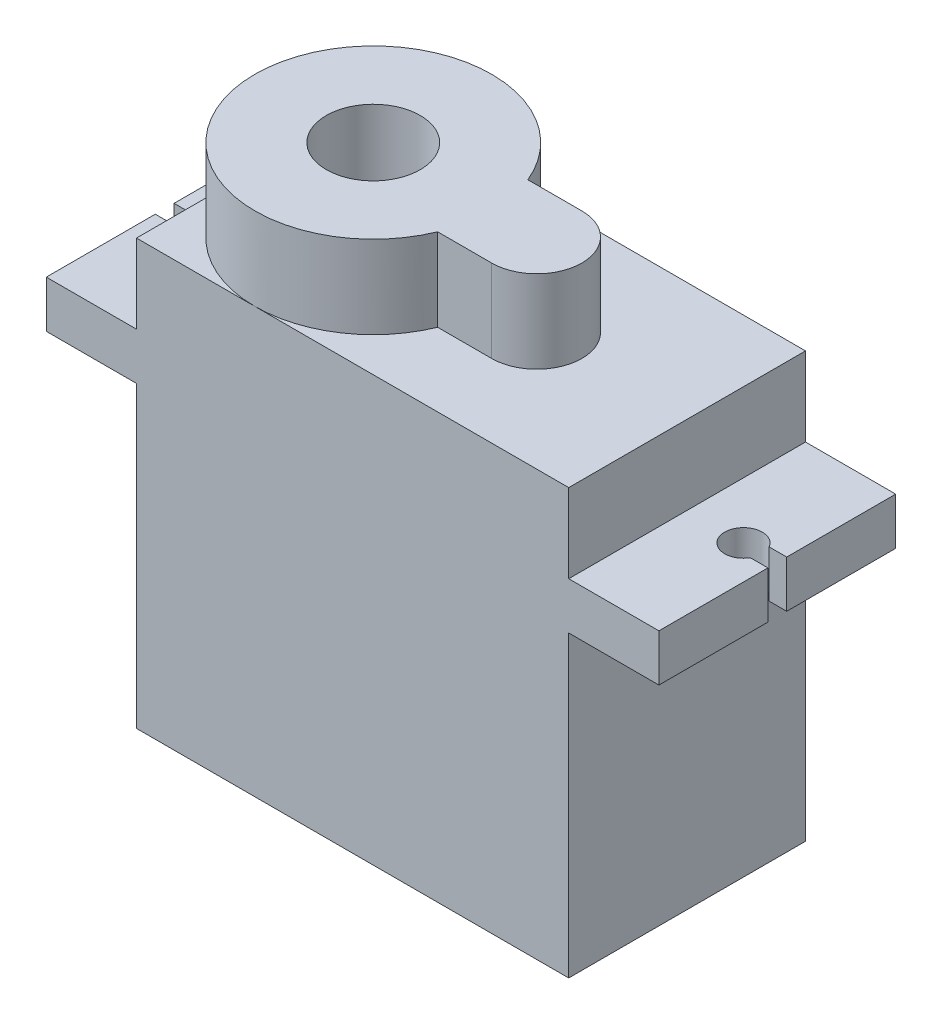
ISO-10303-21;
HEADER;
FILE_DESCRIPTION(('STEP AP214'),'2;1');
FILE_NAME('part.step','',(''),(''),'','','');
FILE_SCHEMA(('AUTOMOTIVE_DESIGN { 1 0 10303 214 1 1 1 1 }'));
ENDSEC;
DATA;
#1=APPLICATION_CONTEXT('core data for automotive mechanical design processes');
#2=APPLICATION_PROTOCOL_DEFINITION('international standard','automotive_design',2000,#1);
#3=PRODUCT_CONTEXT('',#1,'mechanical');
#4=PRODUCT('Part','Part','',(#3));
#5=PRODUCT_RELATED_PRODUCT_CATEGORY('part','',(#4));
#6=PRODUCT_DEFINITION_FORMATION('','',#4);
#7=PRODUCT_DEFINITION_CONTEXT('part definition',#1,'design');
#8=PRODUCT_DEFINITION('design','',#6,#7);
#9=PRODUCT_DEFINITION_SHAPE('','',#8);
#10=(LENGTH_UNIT() NAMED_UNIT(*) SI_UNIT(.MILLI.,.METRE.));
#11=(NAMED_UNIT(*) PLANE_ANGLE_UNIT() SI_UNIT($,.RADIAN.));
#12=(NAMED_UNIT(*) SI_UNIT($,.STERADIAN.) SOLID_ANGLE_UNIT());
#13=UNCERTAINTY_MEASURE_WITH_UNIT(LENGTH_MEASURE(1.E-05),#10,'distance_accuracy_value','');
#14=(GEOMETRIC_REPRESENTATION_CONTEXT(3) GLOBAL_UNCERTAINTY_ASSIGNED_CONTEXT((#13)) GLOBAL_UNIT_ASSIGNED_CONTEXT((#10,
#11,#12)) REPRESENTATION_CONTEXT('',''));
#15=CARTESIAN_POINT('',(0.,0.,0.));
#16=DIRECTION('',(0.,0.,1.));
#17=DIRECTION('',(1.,0.,0.));
#18=AXIS2_PLACEMENT_3D('',#15,#16,#17);
#19=CARTESIAN_POINT('',(-11.5,22.6,12.6));
#20=DIRECTION('',(0.,1.,0.));
#21=DIRECTION('',(0.,0.,1.));
#22=AXIS2_PLACEMENT_3D('',#19,#20,#21);
#23=PLANE('',#22);
#24=CARTESIAN_POINT('',(-5.2,22.6,6.3));
#25=DIRECTION('',(0.,1.,0.));
#26=DIRECTION('',(0.,0.,1.));
#27=AXIS2_PLACEMENT_3D('',#24,#25,#26);
#28=CIRCLE('',#27,6.3);
#29=CARTESIAN_POINT('',(0.624946351684278,22.6,3.9));
#30=VERTEX_POINT('',#29);
#31=CARTESIAN_POINT('',(-5.2,22.6,0.));
#32=VERTEX_POINT('',#31);
#33=EDGE_CURVE('E43',#30,#32,#28,.T.);
#34=ORIENTED_EDGE('',*,*,#33,.F.);
#35=DIRECTION('',(1.,0.,0.));
#36=VECTOR('',#35,1.);
#37=CARTESIAN_POINT('',(0.,22.6,3.9));
#38=LINE('',#37,#36);
#39=CARTESIAN_POINT('',(3.5,22.6,3.9));
#40=VERTEX_POINT('',#39);
#41=EDGE_CURVE('E54',#30,#40,#38,.T.);
#42=ORIENTED_EDGE('',*,*,#41,.T.);
#43=CARTESIAN_POINT('',(3.5,22.6,6.3));
#44=DIRECTION('',(0.,1.,0.));
#45=DIRECTION('',(0.,0.,1.));
#46=AXIS2_PLACEMENT_3D('',#43,#44,#45);
#47=CIRCLE('',#46,2.4);
#48=CARTESIAN_POINT('',(3.5,22.6,8.7));
#49=VERTEX_POINT('',#48);
#50=EDGE_CURVE('E440',#49,#40,#47,.T.);
#51=ORIENTED_EDGE('',*,*,#50,.F.);
#52=DIRECTION('',(1.,0.,0.));
#53=VECTOR('',#52,1.);
#54=CARTESIAN_POINT('',(0.,22.6,8.7));
#55=LINE('',#54,#53);
#56=CARTESIAN_POINT('',(0.624946351684278,22.6,8.7));
#57=VERTEX_POINT('',#56);
#58=EDGE_CURVE('E439',#57,#49,#55,.T.);
#59=ORIENTED_EDGE('',*,*,#58,.F.);
#60=CARTESIAN_POINT('',(-5.2,22.6,12.6));
#61=VERTEX_POINT('',#60);
#62=EDGE_CURVE('E229',#61,#57,#28,.T.);
#63=ORIENTED_EDGE('',*,*,#62,.F.);
#64=DIRECTION('',(1.,0.,0.));
#65=VECTOR('',#64,1.);
#66=CARTESIAN_POINT('',(-11.5,22.6,12.6));
#67=LINE('',#66,#65);
#68=CARTESIAN_POINT('',(11.5,22.6,12.6));
#69=VERTEX_POINT('',#68);
#70=EDGE_CURVE('E307',#61,#69,#67,.T.);
#71=ORIENTED_EDGE('',*,*,#70,.T.);
#72=DIRECTION('',(0.,0.,-1.));
#73=VECTOR('',#72,1.);
#74=CARTESIAN_POINT('',(11.5,22.6,12.6));
#75=LINE('',#74,#73);
#76=CARTESIAN_POINT('',(11.5,22.6,0.));
#77=VERTEX_POINT('',#76);
#78=EDGE_CURVE('E371',#69,#77,#75,.T.);
#79=ORIENTED_EDGE('',*,*,#78,.T.);
#80=DIRECTION('',(1.,0.,0.));
#81=VECTOR('',#80,1.);
#82=CARTESIAN_POINT('',(-11.5,22.6,0.));
#83=LINE('',#82,#81);
#84=EDGE_CURVE('E339',#32,#77,#83,.T.);
#85=ORIENTED_EDGE('',*,*,#84,.F.);
#86=EDGE_LOOP('',(#34,#42,#51,#59,#63,#71,#79,#85));
#87=FACE_BOUND('',#86,.T.);
#88=ADVANCED_FACE('F32',(#87),#23,.T.);
#89=CARTESIAN_POINT('',(-11.5,22.6,6.3));
#90=VERTEX_POINT('',#89);
#91=EDGE_CURVE('E11',#32,#90,#28,.T.);
#92=ORIENTED_EDGE('',*,*,#91,.F.);
#93=CARTESIAN_POINT('',(-11.5,22.6,0.));
#94=VERTEX_POINT('',#93);
#95=EDGE_CURVE('E340',#94,#32,#83,.T.);
#96=ORIENTED_EDGE('',*,*,#95,.F.);
#97=DIRECTION('',(0.,0.,-1.));
#98=VECTOR('',#97,1.);
#99=CARTESIAN_POINT('',(-11.5,22.6,12.6));
#100=LINE('',#99,#98);
#101=EDGE_CURVE('E377',#90,#94,#100,.T.);
#102=ORIENTED_EDGE('',*,*,#101,.F.);
#103=EDGE_LOOP('',(#92,#96,#102));
#104=FACE_BOUND('',#103,.T.);
#105=ADVANCED_FACE('F446',(#104),#23,.T.);
#106=CARTESIAN_POINT('',(-16.3,18.4,12.6));
#107=DIRECTION('',(0.,1.,0.));
#108=DIRECTION('',(0.,0.,1.));
#109=AXIS2_PLACEMENT_3D('',#106,#107,#108);
#110=PLANE('',#109);
#111=DIRECTION('',(1.,0.,0.));
#112=VECTOR('',#111,1.);
#113=CARTESIAN_POINT('',(0.,18.4,6.8));
#114=LINE('',#113,#112);
#115=CARTESIAN_POINT('',(-16.3,18.4,6.8));
#116=VERTEX_POINT('',#115);
#117=CARTESIAN_POINT('',(-15.3660254037844,18.4,6.8));
#118=VERTEX_POINT('',#117);
#119=EDGE_CURVE('E230',#116,#118,#114,.T.);
#120=ORIENTED_EDGE('',*,*,#119,.F.);
#121=DIRECTION('',(0.,0.,-1.));
#122=VECTOR('',#121,1.);
#123=CARTESIAN_POINT('',(-16.3,18.4,12.6));
#124=LINE('',#123,#122);
#125=CARTESIAN_POINT('',(-16.3,18.4,12.6));
#126=VERTEX_POINT('',#125);
#127=EDGE_CURVE('E380',#126,#116,#124,.T.);
#128=ORIENTED_EDGE('',*,*,#127,.F.);
#129=DIRECTION('',(1.,0.,0.));
#130=VECTOR('',#129,1.);
#131=CARTESIAN_POINT('',(-16.3,18.4,12.6));
#132=LINE('',#131,#130);
#133=CARTESIAN_POINT('',(-11.5,18.4,12.6));
#134=VERTEX_POINT('',#133);
#135=EDGE_CURVE('E301',#126,#134,#132,.T.);
#136=ORIENTED_EDGE('',*,*,#135,.T.);
#137=DIRECTION('',(0.,0.,-1.));
#138=VECTOR('',#137,1.);
#139=CARTESIAN_POINT('',(-11.5,18.4,12.6));
#140=LINE('',#139,#138);
#141=CARTESIAN_POINT('',(-11.5,18.4,0.));
#142=VERTEX_POINT('',#141);
#143=EDGE_CURVE('E378',#134,#142,#140,.T.);
#144=ORIENTED_EDGE('',*,*,#143,.T.);
#145=DIRECTION('',(1.,0.,0.));
#146=VECTOR('',#145,1.);
#147=CARTESIAN_POINT('',(-16.3,18.4,0.));
#148=LINE('',#147,#146);
#149=CARTESIAN_POINT('',(-16.3,18.4,0.));
#150=VERTEX_POINT('',#149);
#151=EDGE_CURVE('E333',#150,#142,#148,.T.);
#152=ORIENTED_EDGE('',*,*,#151,.F.);
#153=CARTESIAN_POINT('',(-16.3,18.4,5.8));
#154=VERTEX_POINT('',#153);
#155=EDGE_CURVE('E383',#154,#150,#124,.T.);
#156=ORIENTED_EDGE('',*,*,#155,.F.);
#157=DIRECTION('',(1.,0.,0.));
#158=VECTOR('',#157,1.);
#159=CARTESIAN_POINT('',(0.,18.4,5.8));
#160=LINE('',#159,#158);
#161=CARTESIAN_POINT('',(-15.3660254037844,18.4,5.8));
#162=VERTEX_POINT('',#161);
#163=EDGE_CURVE('E243',#154,#162,#160,.T.);
#164=ORIENTED_EDGE('',*,*,#163,.T.);
#165=CARTESIAN_POINT('',(-14.5,18.4,6.3));
#166=DIRECTION('',(0.,1.,0.));
#167=DIRECTION('',(0.,0.,1.));
#168=AXIS2_PLACEMENT_3D('',#165,#166,#167);
#169=CIRCLE('',#168,1.);
#170=EDGE_CURVE('E233',#162,#118,#169,.F.);
#171=ORIENTED_EDGE('',*,*,#170,.T.);
#172=EDGE_LOOP('',(#120,#128,#136,#144,#152,#156,#164,#171));
#173=FACE_BOUND('',#172,.T.);
#174=ADVANCED_FACE('F429',(#173),#110,.T.);
#175=CARTESIAN_POINT('',(-16.3,15.9,12.6));
#176=DIRECTION('',(-1.,0.,0.));
#177=DIRECTION('',(0.,-1.,0.));
#178=AXIS2_PLACEMENT_3D('',#175,#176,#177);
#179=PLANE('',#178);
#180=DIRECTION('',(0.,0.,-1.));
#181=VECTOR('',#180,1.);
#182=CARTESIAN_POINT('',(-16.3,15.9,12.6));
#183=LINE('',#182,#181);
#184=CARTESIAN_POINT('',(-16.3,15.9,5.8));
#185=VERTEX_POINT('',#184);
#186=CARTESIAN_POINT('',(-16.3,15.9,0.));
#187=VERTEX_POINT('',#186);
#188=EDGE_CURVE('E386',#185,#187,#183,.T.);
#189=ORIENTED_EDGE('',*,*,#188,.F.);
#190=DIRECTION('',(0.,1.,0.));
#191=VECTOR('',#190,1.);
#192=CARTESIAN_POINT('',(-16.3,15.9,5.8));
#193=LINE('',#192,#191);
#194=EDGE_CURVE('E256',#185,#154,#193,.T.);
#195=ORIENTED_EDGE('',*,*,#194,.T.);
#196=ORIENTED_EDGE('',*,*,#155,.T.);
#197=DIRECTION('',(0.,1.,0.));
#198=VECTOR('',#197,1.);
#199=CARTESIAN_POINT('',(-16.3,15.9,0.));
#200=LINE('',#199,#198);
#201=EDGE_CURVE('E330',#187,#150,#200,.T.);
#202=ORIENTED_EDGE('',*,*,#201,.F.);
#203=EDGE_LOOP('',(#189,#195,#196,#202));
#204=FACE_BOUND('',#203,.T.);
#205=ADVANCED_FACE('F425',(#204),#179,.T.);
#206=CARTESIAN_POINT('',(-11.5,15.9,12.6));
#207=DIRECTION('',(0.,-1.,0.));
#208=DIRECTION('',(0.,0.,-1.));
#209=AXIS2_PLACEMENT_3D('',#206,#207,#208);
#210=PLANE('',#209);
#211=DIRECTION('',(1.,0.,0.));
#212=VECTOR('',#211,1.);
#213=CARTESIAN_POINT('',(0.,15.9,6.8));
#214=LINE('',#213,#212);
#215=CARTESIAN_POINT('',(-16.3,15.9,6.8));
#216=VERTEX_POINT('',#215);
#217=CARTESIAN_POINT('',(-15.3660254037844,15.9,6.8));
#218=VERTEX_POINT('',#217);
#219=EDGE_CURVE('E239',#216,#218,#214,.T.);
#220=ORIENTED_EDGE('',*,*,#219,.T.);
#221=CARTESIAN_POINT('',(-14.5,15.9,6.3));
#222=DIRECTION('',(0.,1.,0.));
#223=DIRECTION('',(0.,0.,1.));
#224=AXIS2_PLACEMENT_3D('',#221,#222,#223);
#225=CIRCLE('',#224,1.);
#226=CARTESIAN_POINT('',(-15.3660254037844,15.9,5.8));
#227=VERTEX_POINT('',#226);
#228=EDGE_CURVE('E242',#227,#218,#225,.F.);
#229=ORIENTED_EDGE('',*,*,#228,.F.);
#230=DIRECTION('',(1.,0.,0.));
#231=VECTOR('',#230,1.);
#232=CARTESIAN_POINT('',(0.,15.9,5.8));
#233=LINE('',#232,#231);
#234=EDGE_CURVE('E245',#185,#227,#233,.T.);
#235=ORIENTED_EDGE('',*,*,#234,.F.);
#236=ORIENTED_EDGE('',*,*,#188,.T.);
#237=DIRECTION('',(-1.,0.,0.));
#238=VECTOR('',#237,1.);
#239=CARTESIAN_POINT('',(-11.5,15.9,0.));
#240=LINE('',#239,#238);
#241=CARTESIAN_POINT('',(-11.5,15.9,0.));
#242=VERTEX_POINT('',#241);
#243=EDGE_CURVE('E327',#242,#187,#240,.T.);
#244=ORIENTED_EDGE('',*,*,#243,.F.);
#245=DIRECTION('',(0.,0.,-1.));
#246=VECTOR('',#245,1.);
#247=CARTESIAN_POINT('',(-11.5,15.9,12.6));
#248=LINE('',#247,#246);
#249=CARTESIAN_POINT('',(-11.5,15.9,12.6));
#250=VERTEX_POINT('',#249);
#251=EDGE_CURVE('E387',#250,#242,#248,.T.);
#252=ORIENTED_EDGE('',*,*,#251,.F.);
#253=DIRECTION('',(-1.,0.,0.));
#254=VECTOR('',#253,1.);
#255=CARTESIAN_POINT('',(-11.5,15.9,12.6));
#256=LINE('',#255,#254);
#257=CARTESIAN_POINT('',(-16.3,15.9,12.6));
#258=VERTEX_POINT('',#257);
#259=EDGE_CURVE('E295',#250,#258,#256,.T.);
#260=ORIENTED_EDGE('',*,*,#259,.T.);
#261=EDGE_CURVE('E384',#258,#216,#183,.T.);
#262=ORIENTED_EDGE('',*,*,#261,.T.);
#263=EDGE_LOOP('',(#220,#229,#235,#236,#244,#252,#260,#262));
#264=FACE_BOUND('',#263,.T.);
#265=ADVANCED_FACE('F419',(#264),#210,.T.);
#266=CARTESIAN_POINT('',(16.3,15.9,12.6));
#267=DIRECTION('',(-1.,0.,0.));
#268=DIRECTION('',(0.,-1.,0.));
#269=AXIS2_PLACEMENT_3D('',#266,#267,#268);
#270=PLANE('',#269);
#271=DIRECTION('',(0.,1.,0.));
#272=VECTOR('',#271,1.);
#273=CARTESIAN_POINT('',(16.3,15.9,6.8));
#274=LINE('',#273,#272);
#275=CARTESIAN_POINT('',(16.3,15.9,6.8));
#276=VERTEX_POINT('',#275);
#277=CARTESIAN_POINT('',(16.3,18.4,6.8));
#278=VERTEX_POINT('',#277);
#279=EDGE_CURVE('E281',#276,#278,#274,.T.);
#280=ORIENTED_EDGE('',*,*,#279,.T.);
#281=DIRECTION('',(0.,0.,-1.));
#282=VECTOR('',#281,1.);
#283=CARTESIAN_POINT('',(16.3,18.4,12.6));
#284=LINE('',#283,#282);
#285=CARTESIAN_POINT('',(16.3,18.4,12.6));
#286=VERTEX_POINT('',#285);
#287=EDGE_CURVE('E364',#286,#278,#284,.T.);
#288=ORIENTED_EDGE('',*,*,#287,.F.);
#289=DIRECTION('',(0.,1.,0.));
#290=VECTOR('',#289,1.);
#291=CARTESIAN_POINT('',(16.3,15.9,12.6));
#292=LINE('',#291,#290);
#293=CARTESIAN_POINT('',(16.3,15.9,12.6));
#294=VERTEX_POINT('',#293);
#295=EDGE_CURVE('E316',#294,#286,#292,.T.);
#296=ORIENTED_EDGE('',*,*,#295,.F.);
#297=DIRECTION('',(0.,0.,-1.));
#298=VECTOR('',#297,1.);
#299=CARTESIAN_POINT('',(16.3,15.9,12.6));
#300=LINE('',#299,#298);
#301=EDGE_CURVE('E360',#294,#276,#300,.T.);
#302=ORIENTED_EDGE('',*,*,#301,.T.);
#303=EDGE_LOOP('',(#280,#288,#296,#302));
#304=FACE_BOUND('',#303,.T.);
#305=ADVANCED_FACE('F671',(#304),#270,.F.);
#306=CARTESIAN_POINT('',(11.5,0.,12.6));
#307=DIRECTION('',(0.,-1.,0.));
#308=DIRECTION('',(0.,0.,-1.));
#309=AXIS2_PLACEMENT_3D('',#306,#307,#308);
#310=PLANE('',#309);
#311=DIRECTION('',(-1.,0.,0.));
#312=VECTOR('',#311,1.);
#313=CARTESIAN_POINT('',(11.5,0.,0.));
#314=LINE('',#313,#312);
#315=CARTESIAN_POINT('',(11.5,0.,0.));
#316=VERTEX_POINT('',#315);
#317=CARTESIAN_POINT('',(-11.5,0.,0.));
#318=VERTEX_POINT('',#317);
#319=EDGE_CURVE('E280',#316,#318,#314,.T.);
#320=ORIENTED_EDGE('',*,*,#319,.F.);
#321=DIRECTION('',(0.,0.,-1.));
#322=VECTOR('',#321,1.);
#323=CARTESIAN_POINT('',(11.5,0.,12.6));
#324=LINE('',#323,#322);
#325=CARTESIAN_POINT('',(11.5,0.,12.6));
#326=VERTEX_POINT('',#325);
#327=EDGE_CURVE('E355',#326,#316,#324,.T.);
#328=ORIENTED_EDGE('',*,*,#327,.F.);
#329=DIRECTION('',(-1.,0.,0.));
#330=VECTOR('',#329,1.);
#331=CARTESIAN_POINT('',(11.5,0.,12.6));
#332=LINE('',#331,#330);
#333=CARTESIAN_POINT('',(-11.5,0.,12.6));
#334=VERTEX_POINT('',#333);
#335=EDGE_CURVE('E288',#326,#334,#332,.T.);
#336=ORIENTED_EDGE('',*,*,#335,.T.);
#337=DIRECTION('',(0.,0.,-1.));
#338=VECTOR('',#337,1.);
#339=CARTESIAN_POINT('',(-11.5,0.,12.6));
#340=LINE('',#339,#338);
#341=EDGE_CURVE('E36',#334,#318,#340,.T.);
#342=ORIENTED_EDGE('',*,*,#341,.T.);
#343=EDGE_LOOP('',(#320,#328,#336,#342));
#344=FACE_BOUND('',#343,.T.);
#345=ADVANCED_FACE('F34',(#344),#310,.T.);
#346=CARTESIAN_POINT('',(11.5,0.,12.6));
#347=DIRECTION('',(-1.,0.,0.));
#348=DIRECTION('',(0.,0.,1.));
#349=AXIS2_PLACEMENT_3D('',#346,#347,#348);
#350=PLANE('',#349);
#351=DIRECTION('',(0.,1.,0.));
#352=VECTOR('',#351,1.);
#353=CARTESIAN_POINT('',(11.5,0.,0.));
#354=LINE('',#353,#352);
#355=CARTESIAN_POINT('',(11.5,15.9,0.));
#356=VERTEX_POINT('',#355);
#357=EDGE_CURVE('E292',#316,#356,#354,.T.);
#358=ORIENTED_EDGE('',*,*,#357,.T.);
#359=DIRECTION('',(0.,0.,-1.));
#360=VECTOR('',#359,1.);
#361=CARTESIAN_POINT('',(11.5,15.9,12.6));
#362=LINE('',#361,#360);
#363=CARTESIAN_POINT('',(11.5,15.9,12.6));
#364=VERTEX_POINT('',#363);
#365=EDGE_CURVE('E357',#364,#356,#362,.T.);
#366=ORIENTED_EDGE('',*,*,#365,.F.);
#367=DIRECTION('',(0.,1.,0.));
#368=VECTOR('',#367,1.);
#369=CARTESIAN_POINT('',(11.5,0.,12.6));
#370=LINE('',#369,#368);
#371=EDGE_CURVE('E320',#326,#364,#370,.T.);
#372=ORIENTED_EDGE('',*,*,#371,.F.);
#373=ORIENTED_EDGE('',*,*,#327,.T.);
#374=EDGE_LOOP('',(#358,#366,#372,#373));
#375=FACE_BOUND('',#374,.T.);
#376=ADVANCED_FACE('F403',(#375),#350,.F.);
#377=CARTESIAN_POINT('',(11.5,15.9,12.6));
#378=DIRECTION('',(0.,1.,0.));
#379=DIRECTION('',(0.,0.,1.));
#380=AXIS2_PLACEMENT_3D('',#377,#378,#379);
#381=PLANE('',#380);
#382=CARTESIAN_POINT('',(16.3,15.9,5.8));
#383=VERTEX_POINT('',#382);
#384=CARTESIAN_POINT('',(16.3,15.9,0.));
#385=VERTEX_POINT('',#384);
#386=EDGE_CURVE('E363',#383,#385,#300,.T.);
#387=ORIENTED_EDGE('',*,*,#386,.F.);
#388=DIRECTION('',(-1.,0.,0.));
#389=VECTOR('',#388,1.);
#390=CARTESIAN_POINT('',(0.,15.9,5.79999999999994));
#391=LINE('',#390,#389);
#392=CARTESIAN_POINT('',(15.3660254037844,15.9,5.8));
#393=VERTEX_POINT('',#392);
#394=EDGE_CURVE('E262',#383,#393,#391,.T.);
#395=ORIENTED_EDGE('',*,*,#394,.T.);
#396=CARTESIAN_POINT('',(14.5,15.9,6.3));
#397=DIRECTION('',(0.,1.,0.));
#398=DIRECTION('',(0.,0.,1.));
#399=AXIS2_PLACEMENT_3D('',#396,#397,#398);
#400=CIRCLE('',#399,1.);
#401=CARTESIAN_POINT('',(15.3660254037844,15.9,6.8));
#402=VERTEX_POINT('',#401);
#403=EDGE_CURVE('E265',#393,#402,#400,.T.);
#404=ORIENTED_EDGE('',*,*,#403,.T.);
#405=DIRECTION('',(-1.,0.,0.));
#406=VECTOR('',#405,1.);
#407=CARTESIAN_POINT('',(0.,15.9,6.80000000000006));
#408=LINE('',#407,#406);
#409=EDGE_CURVE('E269',#276,#402,#408,.T.);
#410=ORIENTED_EDGE('',*,*,#409,.F.);
#411=ORIENTED_EDGE('',*,*,#301,.F.);
#412=DIRECTION('',(1.,0.,0.));
#413=VECTOR('',#412,1.);
#414=CARTESIAN_POINT('',(11.5,15.9,12.6));
#415=LINE('',#414,#413);
#416=EDGE_CURVE('E318',#364,#294,#415,.T.);
#417=ORIENTED_EDGE('',*,*,#416,.F.);
#418=ORIENTED_EDGE('',*,*,#365,.T.);
#419=DIRECTION('',(1.,0.,0.));
#420=VECTOR('',#419,1.);
#421=CARTESIAN_POINT('',(11.5,15.9,0.));
#422=LINE('',#421,#420);
#423=EDGE_CURVE('E351',#356,#385,#422,.T.);
#424=ORIENTED_EDGE('',*,*,#423,.T.);
#425=EDGE_LOOP('',(#387,#395,#404,#410,#411,#417,#418,#424));
#426=FACE_BOUND('',#425,.T.);
#427=ADVANCED_FACE('F408',(#426),#381,.F.);
#428=CARTESIAN_POINT('',(16.3,18.4,5.8));
#429=VERTEX_POINT('',#428);
#430=CARTESIAN_POINT('',(16.3,18.4,0.));
#431=VERTEX_POINT('',#430);
#432=EDGE_CURVE('E367',#429,#431,#284,.T.);
#433=ORIENTED_EDGE('',*,*,#432,.F.);
#434=DIRECTION('',(0.,1.,0.));
#435=VECTOR('',#434,1.);
#436=CARTESIAN_POINT('',(16.3,15.9,5.8));
#437=LINE('',#436,#435);
#438=EDGE_CURVE('E278',#383,#429,#437,.T.);
#439=ORIENTED_EDGE('',*,*,#438,.F.);
#440=ORIENTED_EDGE('',*,*,#386,.T.);
#441=DIRECTION('',(0.,1.,0.));
#442=VECTOR('',#441,1.);
#443=CARTESIAN_POINT('',(16.3,15.9,0.));
#444=LINE('',#443,#442);
#445=EDGE_CURVE('E348',#385,#431,#444,.T.);
#446=ORIENTED_EDGE('',*,*,#445,.T.);
#447=EDGE_LOOP('',(#433,#439,#440,#446));
#448=FACE_BOUND('',#447,.T.);
#449=ADVANCED_FACE('F659',(#448),#270,.F.);
#450=CARTESIAN_POINT('',(16.3,18.4,12.6));
#451=DIRECTION('',(0.,-1.,0.));
#452=DIRECTION('',(0.,0.,-1.));
#453=AXIS2_PLACEMENT_3D('',#450,#451,#452);
#454=PLANE('',#453);
#455=CARTESIAN_POINT('',(14.5,18.4,6.3));
#456=DIRECTION('',(0.,1.,0.));
#457=DIRECTION('',(0.,0.,1.));
#458=AXIS2_PLACEMENT_3D('',#455,#456,#457);
#459=CIRCLE('',#458,1.);
#460=CARTESIAN_POINT('',(15.3660254037844,18.4,5.8));
#461=VERTEX_POINT('',#460);
#462=CARTESIAN_POINT('',(15.3660254037844,18.4,6.8));
#463=VERTEX_POINT('',#462);
#464=EDGE_CURVE('E273',#461,#463,#459,.T.);
#465=ORIENTED_EDGE('',*,*,#464,.F.);
#466=DIRECTION('',(-1.,0.,0.));
#467=VECTOR('',#466,1.);
#468=CARTESIAN_POINT('',(0.,18.4,5.79999999999994));
#469=LINE('',#468,#467);
#470=EDGE_CURVE('E255',#429,#461,#469,.T.);
#471=ORIENTED_EDGE('',*,*,#470,.F.);
#472=ORIENTED_EDGE('',*,*,#432,.T.);
#473=DIRECTION('',(-1.,0.,0.));
#474=VECTOR('',#473,1.);
#475=CARTESIAN_POINT('',(16.3,18.4,0.));
#476=LINE('',#475,#474);
#477=CARTESIAN_POINT('',(11.5,18.4,0.));
#478=VERTEX_POINT('',#477);
#479=EDGE_CURVE('E346',#431,#478,#476,.T.);
#480=ORIENTED_EDGE('',*,*,#479,.T.);
#481=DIRECTION('',(0.,0.,-1.));
#482=VECTOR('',#481,1.);
#483=CARTESIAN_POINT('',(11.5,18.4,12.6));
#484=LINE('',#483,#482);
#485=CARTESIAN_POINT('',(11.5,18.4,12.6));
#486=VERTEX_POINT('',#485);
#487=EDGE_CURVE('E368',#486,#478,#484,.T.);
#488=ORIENTED_EDGE('',*,*,#487,.F.);
#489=DIRECTION('',(-1.,0.,0.));
#490=VECTOR('',#489,1.);
#491=CARTESIAN_POINT('',(16.3,18.4,12.6));
#492=LINE('',#491,#490);
#493=EDGE_CURVE('E314',#286,#486,#492,.T.);
#494=ORIENTED_EDGE('',*,*,#493,.F.);
#495=ORIENTED_EDGE('',*,*,#287,.T.);
#496=DIRECTION('',(-1.,0.,0.));
#497=VECTOR('',#496,1.);
#498=CARTESIAN_POINT('',(0.,18.4,6.80000000000006));
#499=LINE('',#498,#497);
#500=EDGE_CURVE('E266',#278,#463,#499,.T.);
#501=ORIENTED_EDGE('',*,*,#500,.T.);
#502=EDGE_LOOP('',(#465,#471,#472,#480,#488,#494,#495,#501));
#503=FACE_BOUND('',#502,.T.);
#504=ADVANCED_FACE('F494',(#503),#454,.F.);
#505=CARTESIAN_POINT('',(11.5,18.4,12.6));
#506=DIRECTION('',(-1.,0.,0.));
#507=DIRECTION('',(0.,0.,1.));
#508=AXIS2_PLACEMENT_3D('',#505,#506,#507);
#509=PLANE('',#508);
#510=DIRECTION('',(0.,1.,0.));
#511=VECTOR('',#510,1.);
#512=CARTESIAN_POINT('',(11.5,18.4,0.));
#513=LINE('',#512,#511);
#514=EDGE_CURVE('E343',#478,#77,#513,.T.);
#515=ORIENTED_EDGE('',*,*,#514,.T.);
#516=ORIENTED_EDGE('',*,*,#78,.F.);
#517=DIRECTION('',(0.,1.,0.));
#518=VECTOR('',#517,1.);
#519=CARTESIAN_POINT('',(11.5,18.4,12.6));
#520=LINE('',#519,#518);
#521=EDGE_CURVE('E311',#486,#69,#520,.T.);
#522=ORIENTED_EDGE('',*,*,#521,.F.);
#523=ORIENTED_EDGE('',*,*,#487,.T.);
#524=EDGE_LOOP('',(#515,#516,#522,#523));
#525=FACE_BOUND('',#524,.T.);
#526=ADVANCED_FACE('F488',(#525),#509,.F.);
#527=EDGE_CURVE('E41',#90,#61,#28,.T.);
#528=ORIENTED_EDGE('',*,*,#527,.F.);
#529=CARTESIAN_POINT('',(-11.5,22.6,12.6));
#530=VERTEX_POINT('',#529);
#531=EDGE_CURVE('E374',#530,#90,#100,.T.);
#532=ORIENTED_EDGE('',*,*,#531,.F.);
#533=EDGE_CURVE('E308',#530,#61,#67,.T.);
#534=ORIENTED_EDGE('',*,*,#533,.T.);
#535=EDGE_LOOP('',(#528,#532,#534));
#536=FACE_BOUND('',#535,.T.);
#537=ADVANCED_FACE('F444',(#536),#23,.T.);
#538=CARTESIAN_POINT('',(-11.5,18.4,12.6));
#539=DIRECTION('',(-1.,0.,0.));
#540=DIRECTION('',(0.,0.,1.));
#541=AXIS2_PLACEMENT_3D('',#538,#539,#540);
#542=PLANE('',#541);
#543=DIRECTION('',(0.,1.,0.));
#544=VECTOR('',#543,1.);
#545=CARTESIAN_POINT('',(-11.5,18.4,0.));
#546=LINE('',#545,#544);
#547=EDGE_CURVE('E336',#142,#94,#546,.T.);
#548=ORIENTED_EDGE('',*,*,#547,.F.);
#549=ORIENTED_EDGE('',*,*,#143,.F.);
#550=DIRECTION('',(0.,1.,0.));
#551=VECTOR('',#550,1.);
#552=CARTESIAN_POINT('',(-11.5,18.4,12.6));
#553=LINE('',#552,#551);
#554=EDGE_CURVE('E304',#134,#530,#553,.T.);
#555=ORIENTED_EDGE('',*,*,#554,.T.);
#556=ORIENTED_EDGE('',*,*,#531,.T.);
#557=ORIENTED_EDGE('',*,*,#101,.T.);
#558=EDGE_LOOP('',(#548,#549,#555,#556,#557));
#559=FACE_BOUND('',#558,.T.);
#560=ADVANCED_FACE('F433',(#559),#542,.T.);
#561=DIRECTION('',(0.,1.,0.));
#562=VECTOR('',#561,1.);
#563=CARTESIAN_POINT('',(-16.3,15.9,6.8));
#564=LINE('',#563,#562);
#565=EDGE_CURVE('E253',#216,#116,#564,.T.);
#566=ORIENTED_EDGE('',*,*,#565,.F.);
#567=ORIENTED_EDGE('',*,*,#261,.F.);
#568=DIRECTION('',(0.,1.,0.));
#569=VECTOR('',#568,1.);
#570=CARTESIAN_POINT('',(-16.3,15.9,12.6));
#571=LINE('',#570,#569);
#572=EDGE_CURVE('E298',#258,#126,#571,.T.);
#573=ORIENTED_EDGE('',*,*,#572,.T.);
#574=ORIENTED_EDGE('',*,*,#127,.T.);
#575=EDGE_LOOP('',(#566,#567,#573,#574));
#576=FACE_BOUND('',#575,.T.);
#577=ADVANCED_FACE('F493',(#576),#179,.T.);
#578=CARTESIAN_POINT('',(-11.5,0.,12.6));
#579=DIRECTION('',(-1.,0.,0.));
#580=DIRECTION('',(0.,0.,1.));
#581=AXIS2_PLACEMENT_3D('',#578,#579,#580);
#582=PLANE('',#581);
#583=DIRECTION('',(0.,1.,0.));
#584=VECTOR('',#583,1.);
#585=CARTESIAN_POINT('',(-11.5,0.,0.));
#586=LINE('',#585,#584);
#587=EDGE_CURVE('E324',#318,#242,#586,.T.);
#588=ORIENTED_EDGE('',*,*,#587,.F.);
#589=ORIENTED_EDGE('',*,*,#341,.F.);
#590=DIRECTION('',(0.,1.,0.));
#591=VECTOR('',#590,1.);
#592=CARTESIAN_POINT('',(-11.5,0.,12.6));
#593=LINE('',#592,#591);
#594=EDGE_CURVE('E291',#334,#250,#593,.T.);
#595=ORIENTED_EDGE('',*,*,#594,.T.);
#596=ORIENTED_EDGE('',*,*,#251,.T.);
#597=EDGE_LOOP('',(#588,#589,#595,#596));
#598=FACE_BOUND('',#597,.T.);
#599=ADVANCED_FACE('F395',(#598),#582,.T.);
#600=CARTESIAN_POINT('',(0.,0.,12.6));
#601=DIRECTION('',(0.,0.,-1.));
#602=DIRECTION('',(-1.,0.,0.));
#603=AXIS2_PLACEMENT_3D('',#600,#601,#602);
#604=PLANE('',#603);
#605=ORIENTED_EDGE('',*,*,#335,.F.);
#606=ORIENTED_EDGE('',*,*,#371,.T.);
#607=ORIENTED_EDGE('',*,*,#416,.T.);
#608=ORIENTED_EDGE('',*,*,#295,.T.);
#609=ORIENTED_EDGE('',*,*,#493,.T.);
#610=ORIENTED_EDGE('',*,*,#521,.T.);
#611=ORIENTED_EDGE('',*,*,#70,.F.);
#612=ORIENTED_EDGE('',*,*,#533,.F.);
#613=ORIENTED_EDGE('',*,*,#554,.F.);
#614=ORIENTED_EDGE('',*,*,#135,.F.);
#615=ORIENTED_EDGE('',*,*,#572,.F.);
#616=ORIENTED_EDGE('',*,*,#259,.F.);
#617=ORIENTED_EDGE('',*,*,#594,.F.);
#618=EDGE_LOOP('',(#605,#606,#607,#608,#609,#610,#611,#612,#613,#614,#615,#616,#617));
#619=FACE_BOUND('',#618,.T.);
#620=ADVANCED_FACE('F413',(#619),#604,.F.);
#621=CARTESIAN_POINT('',(0.,0.,0.));
#622=DIRECTION('',(0.,0.,-1.));
#623=DIRECTION('',(-1.,0.,0.));
#624=AXIS2_PLACEMENT_3D('',#621,#622,#623);
#625=PLANE('',#624);
#626=ORIENTED_EDGE('',*,*,#319,.T.);
#627=ORIENTED_EDGE('',*,*,#587,.T.);
#628=ORIENTED_EDGE('',*,*,#243,.T.);
#629=ORIENTED_EDGE('',*,*,#201,.T.);
#630=ORIENTED_EDGE('',*,*,#151,.T.);
#631=ORIENTED_EDGE('',*,*,#547,.T.);
#632=ORIENTED_EDGE('',*,*,#95,.T.);
#633=ORIENTED_EDGE('',*,*,#84,.T.);
#634=ORIENTED_EDGE('',*,*,#514,.F.);
#635=ORIENTED_EDGE('',*,*,#479,.F.);
#636=ORIENTED_EDGE('',*,*,#445,.F.);
#637=ORIENTED_EDGE('',*,*,#423,.F.);
#638=ORIENTED_EDGE('',*,*,#357,.F.);
#639=EDGE_LOOP('',(#626,#627,#628,#629,#630,#631,#632,#633,#634,#635,#636,#637,#638));
#640=FACE_BOUND('',#639,.T.);
#641=ADVANCED_FACE('F398',(#640),#625,.T.);
#642=CARTESIAN_POINT('',(0.,15.9,5.79999999999994));
#643=DIRECTION('',(0.,0.,-1.));
#644=DIRECTION('',(-1.,0.,0.));
#645=AXIS2_PLACEMENT_3D('',#642,#643,#644);
#646=PLANE('',#645);
#647=ORIENTED_EDGE('',*,*,#470,.T.);
#648=DIRECTION('',(0.,1.,0.));
#649=VECTOR('',#648,1.);
#650=CARTESIAN_POINT('',(15.3660254037844,15.9,5.8));
#651=LINE('',#650,#649);
#652=EDGE_CURVE('E271',#393,#461,#651,.T.);
#653=ORIENTED_EDGE('',*,*,#652,.F.);
#654=ORIENTED_EDGE('',*,*,#394,.F.);
#655=ORIENTED_EDGE('',*,*,#438,.T.);
#656=EDGE_LOOP('',(#647,#653,#654,#655));
#657=FACE_BOUND('',#656,.T.);
#658=ADVANCED_FACE('F551',(#657),#646,.F.);
#659=CARTESIAN_POINT('',(0.,15.9,6.80000000000006));
#660=DIRECTION('',(0.,0.,-1.));
#661=DIRECTION('',(-1.,0.,0.));
#662=AXIS2_PLACEMENT_3D('',#659,#660,#661);
#663=PLANE('',#662);
#664=ORIENTED_EDGE('',*,*,#500,.F.);
#665=ORIENTED_EDGE('',*,*,#279,.F.);
#666=ORIENTED_EDGE('',*,*,#409,.T.);
#667=DIRECTION('',(0.,1.,0.));
#668=VECTOR('',#667,1.);
#669=CARTESIAN_POINT('',(15.3660254037844,15.9,6.8));
#670=LINE('',#669,#668);
#671=EDGE_CURVE('E284',#402,#463,#670,.T.);
#672=ORIENTED_EDGE('',*,*,#671,.T.);
#673=EDGE_LOOP('',(#664,#665,#666,#672));
#674=FACE_BOUND('',#673,.T.);
#675=ADVANCED_FACE('F624',(#674),#663,.T.);
#676=CARTESIAN_POINT('',(14.5,15.9,6.3));
#677=DIRECTION('',(0.,1.,0.));
#678=DIRECTION('',(0.,0.,1.));
#679=AXIS2_PLACEMENT_3D('',#676,#677,#678);
#680=CYLINDRICAL_SURFACE('',#679,1.);
#681=ORIENTED_EDGE('',*,*,#464,.T.);
#682=ORIENTED_EDGE('',*,*,#671,.F.);
#683=ORIENTED_EDGE('',*,*,#403,.F.);
#684=ORIENTED_EDGE('',*,*,#652,.T.);
#685=EDGE_LOOP('',(#681,#682,#683,#684));
#686=FACE_BOUND('',#685,.T.);
#687=ADVANCED_FACE('F614',(#686),#680,.F.);
#688=CARTESIAN_POINT('',(0.,15.9,6.8));
#689=DIRECTION('',(0.,0.,1.));
#690=DIRECTION('',(1.,0.,0.));
#691=AXIS2_PLACEMENT_3D('',#688,#689,#690);
#692=PLANE('',#691);
#693=ORIENTED_EDGE('',*,*,#119,.T.);
#694=DIRECTION('',(0.,1.,0.));
#695=VECTOR('',#694,1.);
#696=CARTESIAN_POINT('',(-15.3660254037844,15.9,6.8));
#697=LINE('',#696,#695);
#698=EDGE_CURVE('E247',#218,#118,#697,.T.);
#699=ORIENTED_EDGE('',*,*,#698,.F.);
#700=ORIENTED_EDGE('',*,*,#219,.F.);
#701=ORIENTED_EDGE('',*,*,#565,.T.);
#702=EDGE_LOOP('',(#693,#699,#700,#701));
#703=FACE_BOUND('',#702,.T.);
#704=ADVANCED_FACE('F604',(#703),#692,.F.);
#705=CARTESIAN_POINT('',(0.,15.9,5.8));
#706=DIRECTION('',(0.,0.,1.));
#707=DIRECTION('',(1.,0.,0.));
#708=AXIS2_PLACEMENT_3D('',#705,#706,#707);
#709=PLANE('',#708);
#710=ORIENTED_EDGE('',*,*,#163,.F.);
#711=ORIENTED_EDGE('',*,*,#194,.F.);
#712=ORIENTED_EDGE('',*,*,#234,.T.);
#713=DIRECTION('',(0.,1.,0.));
#714=VECTOR('',#713,1.);
#715=CARTESIAN_POINT('',(-15.3660254037844,15.9,5.8));
#716=LINE('',#715,#714);
#717=EDGE_CURVE('E259',#227,#162,#716,.T.);
#718=ORIENTED_EDGE('',*,*,#717,.T.);
#719=EDGE_LOOP('',(#710,#711,#712,#718));
#720=FACE_BOUND('',#719,.T.);
#721=ADVANCED_FACE('F594',(#720),#709,.T.);
#722=CARTESIAN_POINT('',(-14.5,15.9,6.3));
#723=DIRECTION('',(0.,1.,0.));
#724=DIRECTION('',(0.,0.,1.));
#725=AXIS2_PLACEMENT_3D('',#722,#723,#724);
#726=CYLINDRICAL_SURFACE('',#725,1.);
#727=ORIENTED_EDGE('',*,*,#170,.F.);
#728=ORIENTED_EDGE('',*,*,#717,.F.);
#729=ORIENTED_EDGE('',*,*,#228,.T.);
#730=ORIENTED_EDGE('',*,*,#698,.T.);
#731=EDGE_LOOP('',(#727,#728,#729,#730));
#732=FACE_BOUND('',#731,.T.);
#733=ADVANCED_FACE('F540',(#732),#726,.F.);
#734=CARTESIAN_POINT('',(-5.2,27.,6.3));
#735=DIRECTION('',(0.,-1.,0.));
#736=DIRECTION('',(0.,0.,-1.));
#737=AXIS2_PLACEMENT_3D('',#734,#735,#736);
#738=CYLINDRICAL_SURFACE('',#737,6.3);
#739=ORIENTED_EDGE('',*,*,#33,.T.);
#740=ORIENTED_EDGE('',*,*,#91,.T.);
#741=ORIENTED_EDGE('',*,*,#527,.T.);
#742=ORIENTED_EDGE('',*,*,#62,.T.);
#743=DIRECTION('',(0.,-1.,0.));
#744=VECTOR('',#743,1.);
#745=CARTESIAN_POINT('',(0.624946351684278,27.,8.7));
#746=LINE('',#745,#744);
#747=CARTESIAN_POINT('',(0.624946351684278,27.,8.7));
#748=VERTEX_POINT('',#747);
#749=EDGE_CURVE('E209',#748,#57,#746,.T.);
#750=ORIENTED_EDGE('',*,*,#749,.F.);
#751=CARTESIAN_POINT('',(-5.2,27.,6.3));
#752=DIRECTION('',(0.,1.,0.));
#753=DIRECTION('',(0.,0.,1.));
#754=AXIS2_PLACEMENT_3D('',#751,#752,#753);
#755=CIRCLE('',#754,6.3);
#756=CARTESIAN_POINT('',(0.624946351684278,27.,3.9));
#757=VERTEX_POINT('',#756);
#758=EDGE_CURVE('E215',#757,#748,#755,.T.);
#759=ORIENTED_EDGE('',*,*,#758,.F.);
#760=DIRECTION('',(0.,-1.,0.));
#761=VECTOR('',#760,1.);
#762=CARTESIAN_POINT('',(0.624946351684278,27.,3.9));
#763=LINE('',#762,#761);
#764=EDGE_CURVE('E438',#757,#30,#763,.T.);
#765=ORIENTED_EDGE('',*,*,#764,.T.);
#766=EDGE_LOOP('',(#739,#740,#741,#742,#750,#759,#765));
#767=FACE_BOUND('',#766,.T.);
#768=ADVANCED_FACE('F227',(#767),#738,.T.);
#769=CARTESIAN_POINT('',(0.,27.,8.7));
#770=DIRECTION('',(0.,0.,-1.));
#771=DIRECTION('',(-1.,0.,0.));
#772=AXIS2_PLACEMENT_3D('',#769,#770,#771);
#773=PLANE('',#772);
#774=ORIENTED_EDGE('',*,*,#58,.T.);
#775=DIRECTION('',(0.,-1.,0.));
#776=VECTOR('',#775,1.);
#777=CARTESIAN_POINT('',(3.5,27.,8.7));
#778=LINE('',#777,#776);
#779=CARTESIAN_POINT('',(3.5,27.,8.7));
#780=VERTEX_POINT('',#779);
#781=EDGE_CURVE('E211',#780,#49,#778,.T.);
#782=ORIENTED_EDGE('',*,*,#781,.F.);
#783=DIRECTION('',(1.,0.,0.));
#784=VECTOR('',#783,1.);
#785=CARTESIAN_POINT('',(0.,27.,8.7));
#786=LINE('',#785,#784);
#787=EDGE_CURVE('E204',#748,#780,#786,.T.);
#788=ORIENTED_EDGE('',*,*,#787,.F.);
#789=ORIENTED_EDGE('',*,*,#749,.T.);
#790=EDGE_LOOP('',(#774,#782,#788,#789));
#791=FACE_BOUND('',#790,.T.);
#792=ADVANCED_FACE('F207',(#791),#773,.F.);
#793=CARTESIAN_POINT('',(3.5,27.,6.3));
#794=DIRECTION('',(0.,-1.,0.));
#795=DIRECTION('',(0.,0.,-1.));
#796=AXIS2_PLACEMENT_3D('',#793,#794,#795);
#797=CYLINDRICAL_SURFACE('',#796,2.4);
#798=ORIENTED_EDGE('',*,*,#50,.T.);
#799=DIRECTION('',(0.,-1.,0.));
#800=VECTOR('',#799,1.);
#801=CARTESIAN_POINT('',(3.5,27.,3.9));
#802=LINE('',#801,#800);
#803=CARTESIAN_POINT('',(3.5,27.,3.9));
#804=VERTEX_POINT('',#803);
#805=EDGE_CURVE('E235',#804,#40,#802,.T.);
#806=ORIENTED_EDGE('',*,*,#805,.F.);
#807=CARTESIAN_POINT('',(3.5,27.,6.3));
#808=DIRECTION('',(0.,1.,0.));
#809=DIRECTION('',(0.,0.,1.));
#810=AXIS2_PLACEMENT_3D('',#807,#808,#809);
#811=CIRCLE('',#810,2.4);
#812=EDGE_CURVE('E214',#780,#804,#811,.T.);
#813=ORIENTED_EDGE('',*,*,#812,.F.);
#814=ORIENTED_EDGE('',*,*,#781,.T.);
#815=EDGE_LOOP('',(#798,#806,#813,#814));
#816=FACE_BOUND('',#815,.T.);
#817=ADVANCED_FACE('F452',(#816),#797,.T.);
#818=CARTESIAN_POINT('',(0.,27.,3.9));
#819=DIRECTION('',(0.,0.,-1.));
#820=DIRECTION('',(-1.,0.,0.));
#821=AXIS2_PLACEMENT_3D('',#818,#819,#820);
#822=PLANE('',#821);
#823=ORIENTED_EDGE('',*,*,#41,.F.);
#824=ORIENTED_EDGE('',*,*,#764,.F.);
#825=DIRECTION('',(1.,0.,0.));
#826=VECTOR('',#825,1.);
#827=CARTESIAN_POINT('',(0.,27.,3.9));
#828=LINE('',#827,#826);
#829=EDGE_CURVE('E222',#757,#804,#828,.T.);
#830=ORIENTED_EDGE('',*,*,#829,.T.);
#831=ORIENTED_EDGE('',*,*,#805,.T.);
#832=EDGE_LOOP('',(#823,#824,#830,#831));
#833=FACE_BOUND('',#832,.T.);
#834=ADVANCED_FACE('F471',(#833),#822,.T.);
#835=CARTESIAN_POINT('',(-5.2,27.,6.3));
#836=DIRECTION('',(0.,-1.,0.));
#837=DIRECTION('',(0.,0.,-1.));
#838=AXIS2_PLACEMENT_3D('',#835,#836,#837);
#839=CYLINDRICAL_SURFACE('',#838,2.5);
#840=CARTESIAN_POINT('',(-5.2,27.,6.3));
#841=DIRECTION('',(0.,1.,0.));
#842=DIRECTION('',(0.,0.,1.));
#843=AXIS2_PLACEMENT_3D('',#840,#841,#842);
#844=CIRCLE('',#843,2.5);
#845=CARTESIAN_POINT('',(-5.2,27.,8.8));
#846=VERTEX_POINT('',#845);
#847=EDGE_CURVE('E455',#846,#846,#844,.T.);
#848=ORIENTED_EDGE('',*,*,#847,.T.);
#849=EDGE_LOOP('',(#848));
#850=FACE_BOUND('',#849,.T.);
#851=CARTESIAN_POINT('',(-5.2,22.6,6.3));
#852=DIRECTION('',(0.,1.,0.));
#853=DIRECTION('',(0.,0.,1.));
#854=AXIS2_PLACEMENT_3D('',#851,#852,#853);
#855=CIRCLE('',#854,2.5);
#856=CARTESIAN_POINT('',(-5.2,22.6,8.8));
#857=VERTEX_POINT('',#856);
#858=EDGE_CURVE('E224',#857,#857,#855,.T.);
#859=ORIENTED_EDGE('',*,*,#858,.F.);
#860=EDGE_LOOP('',(#859));
#861=FACE_BOUND('',#860,.T.);
#862=ADVANCED_FACE('F469',(#850,#861),#839,.F.);
#863=CARTESIAN_POINT('',(0.,27.,0.));
#864=DIRECTION('',(0.,1.,0.));
#865=DIRECTION('',(0.,0.,1.));
#866=AXIS2_PLACEMENT_3D('',#863,#864,#865);
#867=PLANE('',#866);
#868=ORIENTED_EDGE('',*,*,#758,.T.);
#869=ORIENTED_EDGE('',*,*,#787,.T.);
#870=ORIENTED_EDGE('',*,*,#812,.T.);
#871=ORIENTED_EDGE('',*,*,#829,.F.);
#872=EDGE_LOOP('',(#868,#869,#870,#871));
#873=FACE_BOUND('',#872,.T.);
#874=ORIENTED_EDGE('',*,*,#847,.F.);
#875=EDGE_LOOP('',(#874));
#876=FACE_BOUND('',#875,.T.);
#877=ADVANCED_FACE('F219',(#873,#876),#867,.T.);
#878=ORIENTED_EDGE('',*,*,#858,.T.);
#879=EDGE_LOOP('',(#878));
#880=FACE_BOUND('',#879,.T.);
#881=ADVANCED_FACE('F467',(#880),#23,.T.);
#882=CLOSED_SHELL('',(#88,#105,#174,#205,#265,#305,#345,#376,#427,#449,#504,#526,#537,#560,#577,
#599,#620,#641,#658,#675,#687,#704,#721,#733,#768,#792,#817,#834,#862,#877,#881));
#883=MANIFOLD_SOLID_BREP('B2',#882);
#884=ADVANCED_BREP_SHAPE_REPRESENTATION('',(#18,#883),#14);
#885=SHAPE_DEFINITION_REPRESENTATION(#9,#884);
ENDSEC;
END-ISO-10303-21;
